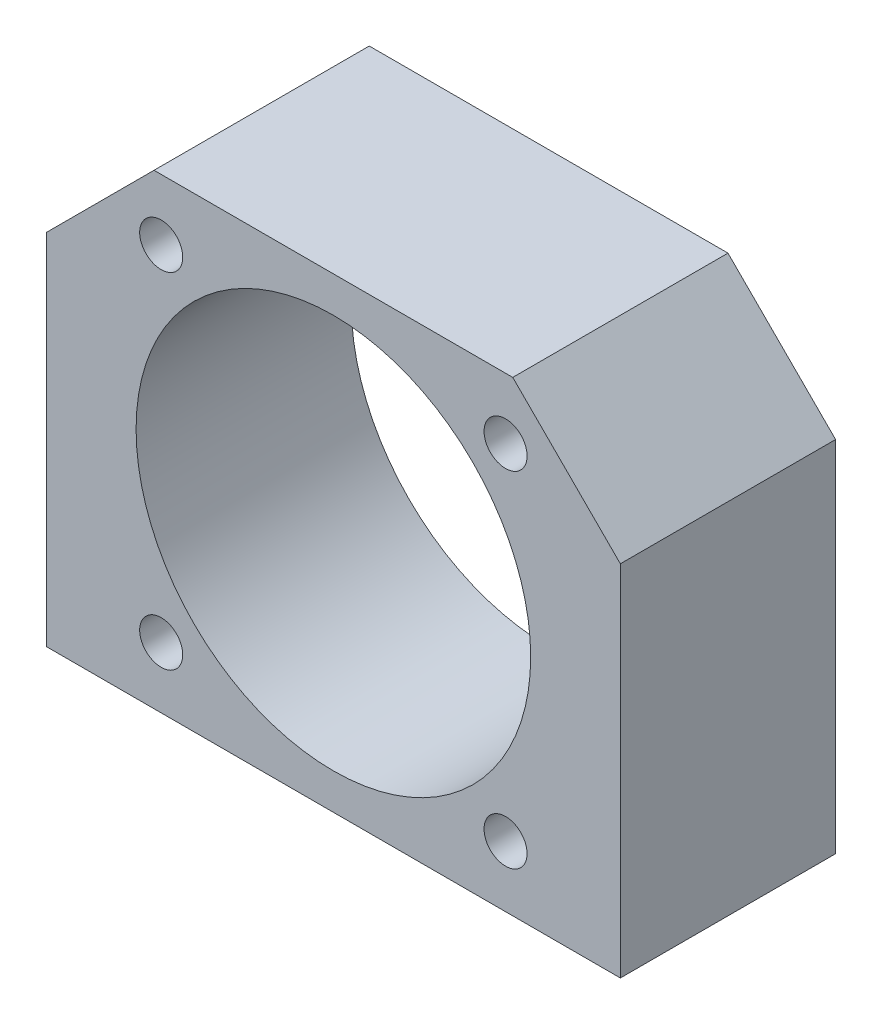
ISO-10303-21;
HEADER;
FILE_DESCRIPTION(('STEP AP214'),'2;1');
FILE_NAME('part.step','',(''),(''),'','','');
FILE_SCHEMA(('AUTOMOTIVE_DESIGN { 1 0 10303 214 1 1 1 1 }'));
ENDSEC;
DATA;
#1=APPLICATION_CONTEXT('core data for automotive mechanical design processes');
#2=APPLICATION_PROTOCOL_DEFINITION('international standard','automotive_design',2000,#1);
#3=PRODUCT_CONTEXT('',#1,'mechanical');
#4=PRODUCT('Part','Part','',(#3));
#5=PRODUCT_RELATED_PRODUCT_CATEGORY('part','',(#4));
#6=PRODUCT_DEFINITION_FORMATION('','',#4);
#7=PRODUCT_DEFINITION_CONTEXT('part definition',#1,'design');
#8=PRODUCT_DEFINITION('design','',#6,#7);
#9=PRODUCT_DEFINITION_SHAPE('','',#8);
#10=(LENGTH_UNIT() NAMED_UNIT(*) SI_UNIT(.MILLI.,.METRE.));
#11=(NAMED_UNIT(*) PLANE_ANGLE_UNIT() SI_UNIT($,.RADIAN.));
#12=(NAMED_UNIT(*) SI_UNIT($,.STERADIAN.) SOLID_ANGLE_UNIT());
#13=UNCERTAINTY_MEASURE_WITH_UNIT(LENGTH_MEASURE(1.E-05),#10,'distance_accuracy_value','');
#14=(GEOMETRIC_REPRESENTATION_CONTEXT(3) GLOBAL_UNCERTAINTY_ASSIGNED_CONTEXT((#13)) GLOBAL_UNIT_ASSIGNED_CONTEXT((#10,
#11,#12)) REPRESENTATION_CONTEXT('',''));
#15=CARTESIAN_POINT('',(0.,0.,0.));
#16=DIRECTION('',(0.,0.,1.));
#17=DIRECTION('',(1.,0.,0.));
#18=AXIS2_PLACEMENT_3D('',#15,#16,#17);
#19=CARTESIAN_POINT('',(-24.,24.,0.));
#20=DIRECTION('',(0.,0.,1.));
#21=DIRECTION('',(1.,0.,0.));
#22=AXIS2_PLACEMENT_3D('',#19,#20,#21);
#23=CYLINDRICAL_SURFACE('',#22,3.);
#24=CARTESIAN_POINT('',(-24.,24.,30.));
#25=DIRECTION('',(0.,0.,1.));
#26=DIRECTION('',(1.,0.,0.));
#27=AXIS2_PLACEMENT_3D('',#24,#25,#26);
#28=CIRCLE('',#27,3.);
#29=CARTESIAN_POINT('',(-21.,24.,30.));
#30=VERTEX_POINT('',#29);
#31=EDGE_CURVE('E168',#30,#30,#28,.T.);
#32=ORIENTED_EDGE('',*,*,#31,.T.);
#33=EDGE_LOOP('',(#32));
#34=FACE_BOUND('',#33,.T.);
#35=CARTESIAN_POINT('',(-24.,24.,6.));
#36=DIRECTION('',(0.,0.,-1.));
#37=DIRECTION('',(-1.,0.,0.));
#38=AXIS2_PLACEMENT_3D('',#35,#36,#37);
#39=CIRCLE('',#38,3.);
#40=CARTESIAN_POINT('',(-27.,24.,6.));
#41=VERTEX_POINT('',#40);
#42=EDGE_CURVE('E39',#41,#41,#39,.F.);
#43=ORIENTED_EDGE('',*,*,#42,.F.);
#44=EDGE_LOOP('',(#43));
#45=FACE_BOUND('',#44,.T.);
#46=ADVANCED_FACE('F35',(#34,#45),#23,.F.);
#47=CARTESIAN_POINT('',(24.,-24.,0.));
#48=DIRECTION('',(0.,0.,1.));
#49=DIRECTION('',(1.,0.,0.));
#50=AXIS2_PLACEMENT_3D('',#47,#48,#49);
#51=CYLINDRICAL_SURFACE('',#50,3.);
#52=CARTESIAN_POINT('',(24.,-24.,30.));
#53=DIRECTION('',(0.,0.,1.));
#54=DIRECTION('',(1.,0.,0.));
#55=AXIS2_PLACEMENT_3D('',#52,#53,#54);
#56=CIRCLE('',#55,3.);
#57=CARTESIAN_POINT('',(27.,-24.,30.));
#58=VERTEX_POINT('',#57);
#59=EDGE_CURVE('E165',#58,#58,#56,.T.);
#60=ORIENTED_EDGE('',*,*,#59,.T.);
#61=EDGE_LOOP('',(#60));
#62=FACE_BOUND('',#61,.T.);
#63=CARTESIAN_POINT('',(24.,-24.,6.));
#64=DIRECTION('',(0.,0.,-1.));
#65=DIRECTION('',(-1.,0.,0.));
#66=AXIS2_PLACEMENT_3D('',#63,#64,#65);
#67=CIRCLE('',#66,3.);
#68=CARTESIAN_POINT('',(21.,-24.,6.));
#69=VERTEX_POINT('',#68);
#70=EDGE_CURVE('E139',#69,#69,#67,.F.);
#71=ORIENTED_EDGE('',*,*,#70,.F.);
#72=EDGE_LOOP('',(#71));
#73=FACE_BOUND('',#72,.T.);
#74=ADVANCED_FACE('F210',(#62,#73),#51,.F.);
#75=CARTESIAN_POINT('',(24.,24.,0.));
#76=DIRECTION('',(0.,0.,1.));
#77=DIRECTION('',(1.,0.,0.));
#78=AXIS2_PLACEMENT_3D('',#75,#76,#77);
#79=CYLINDRICAL_SURFACE('',#78,3.);
#80=CARTESIAN_POINT('',(24.,24.,30.));
#81=DIRECTION('',(0.,0.,1.));
#82=DIRECTION('',(1.,0.,0.));
#83=AXIS2_PLACEMENT_3D('',#80,#81,#82);
#84=CIRCLE('',#83,3.);
#85=CARTESIAN_POINT('',(27.,24.,30.));
#86=VERTEX_POINT('',#85);
#87=EDGE_CURVE('E169',#86,#86,#84,.T.);
#88=ORIENTED_EDGE('',*,*,#87,.T.);
#89=EDGE_LOOP('',(#88));
#90=FACE_BOUND('',#89,.T.);
#91=CARTESIAN_POINT('',(24.,24.,6.));
#92=DIRECTION('',(0.,0.,-1.));
#93=DIRECTION('',(-1.,0.,0.));
#94=AXIS2_PLACEMENT_3D('',#91,#92,#93);
#95=CIRCLE('',#94,3.);
#96=CARTESIAN_POINT('',(21.,24.,6.));
#97=VERTEX_POINT('',#96);
#98=EDGE_CURVE('E136',#97,#97,#95,.F.);
#99=ORIENTED_EDGE('',*,*,#98,.F.);
#100=EDGE_LOOP('',(#99));
#101=FACE_BOUND('',#100,.T.);
#102=ADVANCED_FACE('F216',(#90,#101),#79,.F.);
#103=CARTESIAN_POINT('',(-24.,-24.,0.));
#104=DIRECTION('',(0.,0.,1.));
#105=DIRECTION('',(1.,0.,0.));
#106=AXIS2_PLACEMENT_3D('',#103,#104,#105);
#107=CYLINDRICAL_SURFACE('',#106,3.);
#108=CARTESIAN_POINT('',(-24.,-24.,30.));
#109=DIRECTION('',(0.,0.,1.));
#110=DIRECTION('',(1.,0.,0.));
#111=AXIS2_PLACEMENT_3D('',#108,#109,#110);
#112=CIRCLE('',#111,3.);
#113=CARTESIAN_POINT('',(-21.,-24.,30.));
#114=VERTEX_POINT('',#113);
#115=EDGE_CURVE('E160',#114,#114,#112,.T.);
#116=ORIENTED_EDGE('',*,*,#115,.T.);
#117=EDGE_LOOP('',(#116));
#118=FACE_BOUND('',#117,.T.);
#119=CARTESIAN_POINT('',(-24.,-24.,6.));
#120=DIRECTION('',(0.,0.,-1.));
#121=DIRECTION('',(-1.,0.,0.));
#122=AXIS2_PLACEMENT_3D('',#119,#120,#121);
#123=CIRCLE('',#122,3.);
#124=CARTESIAN_POINT('',(-27.,-24.,6.));
#125=VERTEX_POINT('',#124);
#126=EDGE_CURVE('E133',#125,#125,#123,.F.);
#127=ORIENTED_EDGE('',*,*,#126,.F.);
#128=EDGE_LOOP('',(#127));
#129=FACE_BOUND('',#128,.T.);
#130=ADVANCED_FACE('F222',(#118,#129),#107,.F.);
#131=CARTESIAN_POINT('',(-40.,32.5,30.));
#132=DIRECTION('',(1.,0.,0.));
#133=DIRECTION('',(0.,1.,0.));
#134=AXIS2_PLACEMENT_3D('',#131,#132,#133);
#135=PLANE('',#134);
#136=DIRECTION('',(0.,-1.,0.));
#137=VECTOR('',#136,1.);
#138=CARTESIAN_POINT('',(-40.,32.5,30.));
#139=LINE('',#138,#137);
#140=CARTESIAN_POINT('',(-40.,17.5,30.));
#141=VERTEX_POINT('',#140);
#142=CARTESIAN_POINT('',(-40.,-32.5,30.));
#143=VERTEX_POINT('',#142);
#144=EDGE_CURVE('E91',#141,#143,#139,.T.);
#145=ORIENTED_EDGE('',*,*,#144,.F.);
#146=DIRECTION('',(0.,0.,-1.));
#147=VECTOR('',#146,1.);
#148=CARTESIAN_POINT('',(-40.,17.5,30.));
#149=LINE('',#148,#147);
#150=CARTESIAN_POINT('',(-40.,17.5,0.));
#151=VERTEX_POINT('',#150);
#152=EDGE_CURVE('E115',#141,#151,#149,.T.);
#153=ORIENTED_EDGE('',*,*,#152,.T.);
#154=DIRECTION('',(0.,-1.,0.));
#155=VECTOR('',#154,1.);
#156=CARTESIAN_POINT('',(-40.,32.5,0.));
#157=LINE('',#156,#155);
#158=CARTESIAN_POINT('',(-40.,-32.5,0.));
#159=VERTEX_POINT('',#158);
#160=EDGE_CURVE('E113',#151,#159,#157,.T.);
#161=ORIENTED_EDGE('',*,*,#160,.T.);
#162=DIRECTION('',(0.,0.,-1.));
#163=VECTOR('',#162,1.);
#164=CARTESIAN_POINT('',(-40.,-32.5,30.));
#165=LINE('',#164,#163);
#166=EDGE_CURVE('E106',#143,#159,#165,.T.);
#167=ORIENTED_EDGE('',*,*,#166,.F.);
#168=EDGE_LOOP('',(#145,#153,#161,#167));
#169=FACE_BOUND('',#168,.T.);
#170=ADVANCED_FACE('F111',(#169),#135,.F.);
#171=CARTESIAN_POINT('',(-40.,-32.5,30.));
#172=DIRECTION('',(0.,1.,0.));
#173=DIRECTION('',(0.,0.,1.));
#174=AXIS2_PLACEMENT_3D('',#171,#172,#173);
#175=PLANE('',#174);
#176=CARTESIAN_POINT('',(-33.,-32.5,7.));
#177=DIRECTION('',(0.,-1.,0.));
#178=DIRECTION('',(0.,0.,-1.));
#179=AXIS2_PLACEMENT_3D('',#176,#177,#178);
#180=CIRCLE('',#179,3.);
#181=CARTESIAN_POINT('',(-33.,-32.5,4.));
#182=VERTEX_POINT('',#181);
#183=EDGE_CURVE('E144',#182,#182,#180,.T.);
#184=ORIENTED_EDGE('',*,*,#183,.F.);
#185=EDGE_LOOP('',(#184));
#186=FACE_BOUND('',#185,.T.);
#187=CARTESIAN_POINT('',(33.,-32.5,7.));
#188=DIRECTION('',(0.,-1.,0.));
#189=DIRECTION('',(0.,0.,-1.));
#190=AXIS2_PLACEMENT_3D('',#187,#188,#189);
#191=CIRCLE('',#190,3.);
#192=CARTESIAN_POINT('',(33.,-32.5,4.));
#193=VERTEX_POINT('',#192);
#194=EDGE_CURVE('E153',#193,#193,#191,.T.);
#195=ORIENTED_EDGE('',*,*,#194,.F.);
#196=EDGE_LOOP('',(#195));
#197=FACE_BOUND('',#196,.T.);
#198=CARTESIAN_POINT('',(33.,-32.5,23.));
#199=DIRECTION('',(0.,-1.,0.));
#200=DIRECTION('',(0.,0.,-1.));
#201=AXIS2_PLACEMENT_3D('',#198,#199,#200);
#202=CIRCLE('',#201,3.);
#203=CARTESIAN_POINT('',(33.,-32.5,20.));
#204=VERTEX_POINT('',#203);
#205=EDGE_CURVE('E444',#204,#204,#202,.T.);
#206=ORIENTED_EDGE('',*,*,#205,.F.);
#207=EDGE_LOOP('',(#206));
#208=FACE_BOUND('',#207,.T.);
#209=CARTESIAN_POINT('',(-33.,-32.5,23.));
#210=DIRECTION('',(0.,-1.,0.));
#211=DIRECTION('',(0.,0.,-1.));
#212=AXIS2_PLACEMENT_3D('',#209,#210,#211);
#213=CIRCLE('',#212,3.);
#214=CARTESIAN_POINT('',(-33.,-32.5,20.));
#215=VERTEX_POINT('',#214);
#216=EDGE_CURVE('E161',#215,#215,#213,.T.);
#217=ORIENTED_EDGE('',*,*,#216,.F.);
#218=EDGE_LOOP('',(#217));
#219=FACE_BOUND('',#218,.T.);
#220=DIRECTION('',(1.,0.,0.));
#221=VECTOR('',#220,1.);
#222=CARTESIAN_POINT('',(-40.,-32.5,0.));
#223=LINE('',#222,#221);
#224=CARTESIAN_POINT('',(40.,-32.5,0.));
#225=VERTEX_POINT('',#224);
#226=EDGE_CURVE('E185',#159,#225,#223,.T.);
#227=ORIENTED_EDGE('',*,*,#226,.T.);
#228=DIRECTION('',(0.,0.,-1.));
#229=VECTOR('',#228,1.);
#230=CARTESIAN_POINT('',(40.,-32.5,30.));
#231=LINE('',#230,#229);
#232=CARTESIAN_POINT('',(40.,-32.5,30.));
#233=VERTEX_POINT('',#232);
#234=EDGE_CURVE('E108',#233,#225,#231,.T.);
#235=ORIENTED_EDGE('',*,*,#234,.F.);
#236=DIRECTION('',(1.,0.,0.));
#237=VECTOR('',#236,1.);
#238=CARTESIAN_POINT('',(-40.,-32.5,30.));
#239=LINE('',#238,#237);
#240=EDGE_CURVE('E94',#143,#233,#239,.T.);
#241=ORIENTED_EDGE('',*,*,#240,.F.);
#242=ORIENTED_EDGE('',*,*,#166,.T.);
#243=EDGE_LOOP('',(#227,#235,#241,#242));
#244=FACE_BOUND('',#243,.T.);
#245=ADVANCED_FACE('F105',(#186,#197,#208,#219,#244),#175,.F.);
#246=CARTESIAN_POINT('',(40.,32.5,30.));
#247=DIRECTION('',(-1.,0.,0.));
#248=DIRECTION('',(0.,-1.,0.));
#249=AXIS2_PLACEMENT_3D('',#246,#247,#248);
#250=PLANE('',#249);
#251=DIRECTION('',(0.,1.,0.));
#252=VECTOR('',#251,1.);
#253=CARTESIAN_POINT('',(40.,32.5,0.));
#254=LINE('',#253,#252);
#255=CARTESIAN_POINT('',(40.,17.4999999999999,0.));
#256=VERTEX_POINT('',#255);
#257=EDGE_CURVE('E187',#225,#256,#254,.T.);
#258=ORIENTED_EDGE('',*,*,#257,.T.);
#259=DIRECTION('',(0.,0.,1.));
#260=VECTOR('',#259,1.);
#261=CARTESIAN_POINT('',(40.,17.4999999999999,30.));
#262=LINE('',#261,#260);
#263=CARTESIAN_POINT('',(40.,17.4999999999999,30.));
#264=VERTEX_POINT('',#263);
#265=EDGE_CURVE('E11',#256,#264,#262,.T.);
#266=ORIENTED_EDGE('',*,*,#265,.T.);
#267=DIRECTION('',(0.,1.,0.));
#268=VECTOR('',#267,1.);
#269=CARTESIAN_POINT('',(40.,32.5,30.));
#270=LINE('',#269,#268);
#271=EDGE_CURVE('E109',#233,#264,#270,.T.);
#272=ORIENTED_EDGE('',*,*,#271,.F.);
#273=ORIENTED_EDGE('',*,*,#234,.T.);
#274=EDGE_LOOP('',(#258,#266,#272,#273));
#275=FACE_BOUND('',#274,.T.);
#276=ADVANCED_FACE('F196',(#275),#250,.F.);
#277=CARTESIAN_POINT('',(-40.,32.5,30.));
#278=DIRECTION('',(0.,-1.,0.));
#279=DIRECTION('',(0.,0.,-1.));
#280=AXIS2_PLACEMENT_3D('',#277,#278,#279);
#281=PLANE('',#280);
#282=DIRECTION('',(-1.,0.,0.));
#283=VECTOR('',#282,1.);
#284=CARTESIAN_POINT('',(-40.,32.5,0.));
#285=LINE('',#284,#283);
#286=CARTESIAN_POINT('',(25.,32.5,0.));
#287=VERTEX_POINT('',#286);
#288=CARTESIAN_POINT('',(-25.,32.5,0.));
#289=VERTEX_POINT('',#288);
#290=EDGE_CURVE('E101',#287,#289,#285,.T.);
#291=ORIENTED_EDGE('',*,*,#290,.T.);
#292=DIRECTION('',(0.,0.,1.));
#293=VECTOR('',#292,1.);
#294=CARTESIAN_POINT('',(-25.,32.5,30.));
#295=LINE('',#294,#293);
#296=CARTESIAN_POINT('',(-25.,32.5,30.));
#297=VERTEX_POINT('',#296);
#298=EDGE_CURVE('E58',#289,#297,#295,.T.);
#299=ORIENTED_EDGE('',*,*,#298,.T.);
#300=DIRECTION('',(-1.,0.,0.));
#301=VECTOR('',#300,1.);
#302=CARTESIAN_POINT('',(-40.,32.5,30.));
#303=LINE('',#302,#301);
#304=CARTESIAN_POINT('',(25.,32.5,30.));
#305=VERTEX_POINT('',#304);
#306=EDGE_CURVE('E119',#305,#297,#303,.T.);
#307=ORIENTED_EDGE('',*,*,#306,.F.);
#308=DIRECTION('',(0.,0.,-1.));
#309=VECTOR('',#308,1.);
#310=CARTESIAN_POINT('',(25.,32.5,30.));
#311=LINE('',#310,#309);
#312=EDGE_CURVE('E126',#305,#287,#311,.T.);
#313=ORIENTED_EDGE('',*,*,#312,.T.);
#314=EDGE_LOOP('',(#291,#299,#307,#313));
#315=FACE_BOUND('',#314,.T.);
#316=ADVANCED_FACE('F189',(#315),#281,.F.);
#317=CARTESIAN_POINT('',(0.,0.,30.));
#318=DIRECTION('',(0.,0.,1.));
#319=DIRECTION('',(1.,0.,0.));
#320=AXIS2_PLACEMENT_3D('',#317,#318,#319);
#321=PLANE('',#320);
#322=ORIENTED_EDGE('',*,*,#115,.F.);
#323=EDGE_LOOP('',(#322));
#324=FACE_BOUND('',#323,.T.);
#325=ORIENTED_EDGE('',*,*,#87,.F.);
#326=EDGE_LOOP('',(#325));
#327=FACE_BOUND('',#326,.T.);
#328=ORIENTED_EDGE('',*,*,#59,.F.);
#329=EDGE_LOOP('',(#328));
#330=FACE_BOUND('',#329,.T.);
#331=ORIENTED_EDGE('',*,*,#31,.F.);
#332=EDGE_LOOP('',(#331));
#333=FACE_BOUND('',#332,.T.);
#334=CARTESIAN_POINT('',(0.,0.,30.));
#335=DIRECTION('',(0.,0.,1.));
#336=DIRECTION('',(1.,0.,0.));
#337=AXIS2_PLACEMENT_3D('',#334,#335,#336);
#338=CIRCLE('',#337,27.5);
#339=CARTESIAN_POINT('',(27.5,0.,30.));
#340=VERTEX_POINT('',#339);
#341=EDGE_CURVE('E176',#340,#340,#338,.T.);
#342=ORIENTED_EDGE('',*,*,#341,.F.);
#343=EDGE_LOOP('',(#342));
#344=FACE_BOUND('',#343,.T.);
#345=ORIENTED_EDGE('',*,*,#306,.T.);
#346=DIRECTION('',(0.707106781186549,0.707106781186546,0.));
#347=VECTOR('',#346,1.);
#348=CARTESIAN_POINT('',(-28.7499999999999,28.75,30.));
#349=LINE('',#348,#347);
#350=EDGE_CURVE('E44',#297,#141,#349,.F.);
#351=ORIENTED_EDGE('',*,*,#350,.T.);
#352=ORIENTED_EDGE('',*,*,#144,.T.);
#353=ORIENTED_EDGE('',*,*,#240,.T.);
#354=ORIENTED_EDGE('',*,*,#271,.T.);
#355=DIRECTION('',(0.707106781186546,-0.707106781186549,0.));
#356=VECTOR('',#355,1.);
#357=CARTESIAN_POINT('',(28.75,28.7499999999999,30.));
#358=LINE('',#357,#356);
#359=EDGE_CURVE('E130',#264,#305,#358,.F.);
#360=ORIENTED_EDGE('',*,*,#359,.T.);
#361=EDGE_LOOP('',(#345,#351,#352,#353,#354,#360));
#362=FACE_BOUND('',#361,.T.);
#363=ADVANCED_FACE('F93',(#324,#327,#330,#333,#344,#362),#321,.T.);
#364=CARTESIAN_POINT('',(0.,0.,0.));
#365=DIRECTION('',(0.,0.,1.));
#366=DIRECTION('',(1.,0.,0.));
#367=AXIS2_PLACEMENT_3D('',#364,#365,#366);
#368=PLANE('',#367);
#369=CARTESIAN_POINT('',(-24.,24.,0.));
#370=DIRECTION('',(0.,0.,-1.));
#371=DIRECTION('',(-1.,0.,0.));
#372=AXIS2_PLACEMENT_3D('',#369,#370,#371);
#373=CIRCLE('',#372,5.);
#374=CARTESIAN_POINT('',(-29.,24.,0.));
#375=VERTEX_POINT('',#374);
#376=EDGE_CURVE('E431',#375,#375,#373,.T.);
#377=ORIENTED_EDGE('',*,*,#376,.F.);
#378=EDGE_LOOP('',(#377));
#379=FACE_BOUND('',#378,.T.);
#380=CARTESIAN_POINT('',(24.,24.,0.));
#381=DIRECTION('',(0.,0.,-1.));
#382=DIRECTION('',(-1.,0.,0.));
#383=AXIS2_PLACEMENT_3D('',#380,#381,#382);
#384=CIRCLE('',#383,5.);
#385=CARTESIAN_POINT('',(19.,24.,0.));
#386=VERTEX_POINT('',#385);
#387=EDGE_CURVE('E433',#386,#386,#384,.T.);
#388=ORIENTED_EDGE('',*,*,#387,.F.);
#389=EDGE_LOOP('',(#388));
#390=FACE_BOUND('',#389,.T.);
#391=CARTESIAN_POINT('',(24.,-24.,0.));
#392=DIRECTION('',(0.,0.,-1.));
#393=DIRECTION('',(-1.,0.,0.));
#394=AXIS2_PLACEMENT_3D('',#391,#392,#393);
#395=CIRCLE('',#394,5.);
#396=CARTESIAN_POINT('',(19.,-24.,0.));
#397=VERTEX_POINT('',#396);
#398=EDGE_CURVE('E461',#397,#397,#395,.T.);
#399=ORIENTED_EDGE('',*,*,#398,.F.);
#400=EDGE_LOOP('',(#399));
#401=FACE_BOUND('',#400,.T.);
#402=CARTESIAN_POINT('',(-24.,-24.,0.));
#403=DIRECTION('',(0.,0.,-1.));
#404=DIRECTION('',(-1.,0.,0.));
#405=AXIS2_PLACEMENT_3D('',#402,#403,#404);
#406=CIRCLE('',#405,5.);
#407=CARTESIAN_POINT('',(-29.,-24.,0.));
#408=VERTEX_POINT('',#407);
#409=EDGE_CURVE('E438',#408,#408,#406,.T.);
#410=ORIENTED_EDGE('',*,*,#409,.F.);
#411=EDGE_LOOP('',(#410));
#412=FACE_BOUND('',#411,.T.);
#413=CARTESIAN_POINT('',(0.,0.,0.));
#414=DIRECTION('',(0.,0.,1.));
#415=DIRECTION('',(1.,0.,0.));
#416=AXIS2_PLACEMENT_3D('',#413,#414,#415);
#417=CIRCLE('',#416,27.5);
#418=CARTESIAN_POINT('',(27.5,0.,0.));
#419=VERTEX_POINT('',#418);
#420=EDGE_CURVE('E177',#419,#419,#417,.T.);
#421=ORIENTED_EDGE('',*,*,#420,.T.);
#422=EDGE_LOOP('',(#421));
#423=FACE_BOUND('',#422,.T.);
#424=ORIENTED_EDGE('',*,*,#160,.F.);
#425=DIRECTION('',(-0.707106781186549,-0.707106781186546,0.));
#426=VECTOR('',#425,1.);
#427=CARTESIAN_POINT('',(-40.,17.5,0.));
#428=LINE('',#427,#426);
#429=EDGE_CURVE('E124',#151,#289,#428,.F.);
#430=ORIENTED_EDGE('',*,*,#429,.T.);
#431=ORIENTED_EDGE('',*,*,#290,.F.);
#432=DIRECTION('',(-0.707106781186546,0.707106781186549,0.));
#433=VECTOR('',#432,1.);
#434=CARTESIAN_POINT('',(25.,32.5,0.));
#435=LINE('',#434,#433);
#436=EDGE_CURVE('E117',#287,#256,#435,.F.);
#437=ORIENTED_EDGE('',*,*,#436,.T.);
#438=ORIENTED_EDGE('',*,*,#257,.F.);
#439=ORIENTED_EDGE('',*,*,#226,.F.);
#440=EDGE_LOOP('',(#424,#430,#431,#437,#438,#439));
#441=FACE_BOUND('',#440,.T.);
#442=ADVANCED_FACE('F194',(#379,#390,#401,#412,#423,#441),#368,.F.);
#443=CARTESIAN_POINT('',(0.,0.,0.));
#444=DIRECTION('',(0.,0.,1.));
#445=DIRECTION('',(1.,0.,0.));
#446=AXIS2_PLACEMENT_3D('',#443,#444,#445);
#447=CYLINDRICAL_SURFACE('',#446,27.5);
#448=ORIENTED_EDGE('',*,*,#420,.F.);
#449=EDGE_LOOP('',(#448));
#450=FACE_BOUND('',#449,.T.);
#451=ORIENTED_EDGE('',*,*,#341,.T.);
#452=EDGE_LOOP('',(#451));
#453=FACE_BOUND('',#452,.T.);
#454=ADVANCED_FACE('F208',(#450,#453),#447,.F.);
#455=CARTESIAN_POINT('',(-40.,17.5,30.));
#456=DIRECTION('',(0.707106781186546,-0.707106781186549,0.));
#457=DIRECTION('',(0.,0.,-1.));
#458=AXIS2_PLACEMENT_3D('',#455,#456,#457);
#459=PLANE('',#458);
#460=ORIENTED_EDGE('',*,*,#350,.F.);
#461=ORIENTED_EDGE('',*,*,#298,.F.);
#462=ORIENTED_EDGE('',*,*,#429,.F.);
#463=ORIENTED_EDGE('',*,*,#152,.F.);
#464=EDGE_LOOP('',(#460,#461,#462,#463));
#465=FACE_BOUND('',#464,.T.);
#466=ADVANCED_FACE('F193',(#465),#459,.F.);
#467=CARTESIAN_POINT('',(25.,32.5,30.));
#468=DIRECTION('',(-0.707106781186549,-0.707106781186546,0.));
#469=DIRECTION('',(0.,0.,-1.));
#470=AXIS2_PLACEMENT_3D('',#467,#468,#469);
#471=PLANE('',#470);
#472=ORIENTED_EDGE('',*,*,#359,.F.);
#473=ORIENTED_EDGE('',*,*,#265,.F.);
#474=ORIENTED_EDGE('',*,*,#436,.F.);
#475=ORIENTED_EDGE('',*,*,#312,.F.);
#476=EDGE_LOOP('',(#472,#473,#474,#475));
#477=FACE_BOUND('',#476,.T.);
#478=ADVANCED_FACE('F37',(#477),#471,.F.);
#479=CARTESIAN_POINT('',(-33.,-7.50000000000001,23.));
#480=DIRECTION('',(0.,-1.,0.));
#481=DIRECTION('',(0.,0.,-1.));
#482=AXIS2_PLACEMENT_3D('',#479,#480,#481);
#483=CYLINDRICAL_SURFACE('',#482,3.);
#484=CARTESIAN_POINT('',(-33.,-7.50000000000001,23.));
#485=DIRECTION('',(0.,-1.,0.));
#486=DIRECTION('',(0.,0.,-1.));
#487=AXIS2_PLACEMENT_3D('',#484,#485,#486);
#488=CIRCLE('',#487,3.);
#489=CARTESIAN_POINT('',(-33.,-7.50000000000001,20.));
#490=VERTEX_POINT('',#489);
#491=EDGE_CURVE('E157',#490,#490,#488,.T.);
#492=ORIENTED_EDGE('',*,*,#491,.F.);
#493=EDGE_LOOP('',(#492));
#494=FACE_BOUND('',#493,.T.);
#495=ORIENTED_EDGE('',*,*,#216,.T.);
#496=EDGE_LOOP('',(#495));
#497=FACE_BOUND('',#496,.T.);
#498=ADVANCED_FACE('F200',(#494,#497),#483,.F.);
#499=CARTESIAN_POINT('',(-33.,-7.50000000000001,23.));
#500=DIRECTION('',(0.,-1.,0.));
#501=DIRECTION('',(0.,0.,-1.));
#502=AXIS2_PLACEMENT_3D('',#499,#500,#501);
#503=PLANE('',#502);
#504=ORIENTED_EDGE('',*,*,#491,.T.);
#505=EDGE_LOOP('',(#504));
#506=FACE_BOUND('',#505,.T.);
#507=ADVANCED_FACE('F205',(#506),#503,.T.);
#508=CARTESIAN_POINT('',(33.,-7.50000000000001,23.));
#509=DIRECTION('',(0.,-1.,0.));
#510=DIRECTION('',(0.,0.,-1.));
#511=AXIS2_PLACEMENT_3D('',#508,#509,#510);
#512=CYLINDRICAL_SURFACE('',#511,3.);
#513=CARTESIAN_POINT('',(33.,-7.50000000000001,23.));
#514=DIRECTION('',(0.,-1.,0.));
#515=DIRECTION('',(0.,0.,-1.));
#516=AXIS2_PLACEMENT_3D('',#513,#514,#515);
#517=CIRCLE('',#516,3.);
#518=CARTESIAN_POINT('',(33.,-7.50000000000001,20.));
#519=VERTEX_POINT('',#518);
#520=EDGE_CURVE('E164',#519,#519,#517,.T.);
#521=ORIENTED_EDGE('',*,*,#520,.F.);
#522=EDGE_LOOP('',(#521));
#523=FACE_BOUND('',#522,.T.);
#524=ORIENTED_EDGE('',*,*,#205,.T.);
#525=EDGE_LOOP('',(#524));
#526=FACE_BOUND('',#525,.T.);
#527=ADVANCED_FACE('F278',(#523,#526),#512,.F.);
#528=CARTESIAN_POINT('',(33.,-7.50000000000001,23.));
#529=DIRECTION('',(0.,-1.,0.));
#530=DIRECTION('',(0.,0.,-1.));
#531=AXIS2_PLACEMENT_3D('',#528,#529,#530);
#532=PLANE('',#531);
#533=ORIENTED_EDGE('',*,*,#520,.T.);
#534=EDGE_LOOP('',(#533));
#535=FACE_BOUND('',#534,.T.);
#536=ADVANCED_FACE('F274',(#535),#532,.T.);
#537=CARTESIAN_POINT('',(33.,-7.50000000000001,7.));
#538=DIRECTION('',(0.,-1.,0.));
#539=DIRECTION('',(0.,0.,-1.));
#540=AXIS2_PLACEMENT_3D('',#537,#538,#539);
#541=CYLINDRICAL_SURFACE('',#540,3.);
#542=CARTESIAN_POINT('',(33.,-7.50000000000001,7.));
#543=DIRECTION('',(0.,-1.,0.));
#544=DIRECTION('',(0.,0.,-1.));
#545=AXIS2_PLACEMENT_3D('',#542,#543,#544);
#546=CIRCLE('',#545,3.);
#547=CARTESIAN_POINT('',(33.,-7.50000000000001,4.));
#548=VERTEX_POINT('',#547);
#549=EDGE_CURVE('E447',#548,#548,#546,.T.);
#550=ORIENTED_EDGE('',*,*,#549,.F.);
#551=EDGE_LOOP('',(#550));
#552=FACE_BOUND('',#551,.T.);
#553=ORIENTED_EDGE('',*,*,#194,.T.);
#554=EDGE_LOOP('',(#553));
#555=FACE_BOUND('',#554,.T.);
#556=ADVANCED_FACE('F277',(#552,#555),#541,.F.);
#557=CARTESIAN_POINT('',(33.,-7.50000000000001,7.));
#558=DIRECTION('',(0.,-1.,0.));
#559=DIRECTION('',(0.,0.,-1.));
#560=AXIS2_PLACEMENT_3D('',#557,#558,#559);
#561=PLANE('',#560);
#562=ORIENTED_EDGE('',*,*,#549,.T.);
#563=EDGE_LOOP('',(#562));
#564=FACE_BOUND('',#563,.T.);
#565=ADVANCED_FACE('F283',(#564),#561,.T.);
#566=CARTESIAN_POINT('',(-33.,-7.50000000000001,7.));
#567=DIRECTION('',(0.,-1.,0.));
#568=DIRECTION('',(0.,0.,-1.));
#569=AXIS2_PLACEMENT_3D('',#566,#567,#568);
#570=CYLINDRICAL_SURFACE('',#569,3.);
#571=CARTESIAN_POINT('',(-33.,-7.50000000000001,7.));
#572=DIRECTION('',(0.,-1.,0.));
#573=DIRECTION('',(0.,0.,-1.));
#574=AXIS2_PLACEMENT_3D('',#571,#572,#573);
#575=CIRCLE('',#574,3.);
#576=CARTESIAN_POINT('',(-33.,-7.50000000000001,4.));
#577=VERTEX_POINT('',#576);
#578=EDGE_CURVE('E148',#577,#577,#575,.T.);
#579=ORIENTED_EDGE('',*,*,#578,.F.);
#580=EDGE_LOOP('',(#579));
#581=FACE_BOUND('',#580,.T.);
#582=ORIENTED_EDGE('',*,*,#183,.T.);
#583=EDGE_LOOP('',(#582));
#584=FACE_BOUND('',#583,.T.);
#585=ADVANCED_FACE('F266',(#581,#584),#570,.F.);
#586=CARTESIAN_POINT('',(-33.,-7.50000000000001,7.));
#587=DIRECTION('',(0.,-1.,0.));
#588=DIRECTION('',(0.,0.,-1.));
#589=AXIS2_PLACEMENT_3D('',#586,#587,#588);
#590=PLANE('',#589);
#591=ORIENTED_EDGE('',*,*,#578,.T.);
#592=EDGE_LOOP('',(#591));
#593=FACE_BOUND('',#592,.T.);
#594=ADVANCED_FACE('F256',(#593),#590,.T.);
#595=CARTESIAN_POINT('',(-24.,-24.,6.));
#596=DIRECTION('',(0.,0.,-1.));
#597=DIRECTION('',(-1.,0.,0.));
#598=AXIS2_PLACEMENT_3D('',#595,#596,#597);
#599=PLANE('',#598);
#600=CARTESIAN_POINT('',(-24.,-24.,6.));
#601=DIRECTION('',(0.,0.,-1.));
#602=DIRECTION('',(-1.,0.,0.));
#603=AXIS2_PLACEMENT_3D('',#600,#601,#602);
#604=CIRCLE('',#603,5.);
#605=CARTESIAN_POINT('',(-29.,-24.,6.));
#606=VERTEX_POINT('',#605);
#607=EDGE_CURVE('E137',#606,#606,#604,.T.);
#608=ORIENTED_EDGE('',*,*,#607,.T.);
#609=EDGE_LOOP('',(#608));
#610=FACE_BOUND('',#609,.T.);
#611=ORIENTED_EDGE('',*,*,#126,.T.);
#612=EDGE_LOOP('',(#611));
#613=FACE_BOUND('',#612,.T.);
#614=ADVANCED_FACE('F253',(#610,#613),#599,.T.);
#615=CARTESIAN_POINT('',(-24.,-24.,6.));
#616=DIRECTION('',(0.,0.,-1.));
#617=DIRECTION('',(-1.,0.,0.));
#618=AXIS2_PLACEMENT_3D('',#615,#616,#617);
#619=CYLINDRICAL_SURFACE('',#618,5.);
#620=ORIENTED_EDGE('',*,*,#607,.F.);
#621=EDGE_LOOP('',(#620));
#622=FACE_BOUND('',#621,.T.);
#623=ORIENTED_EDGE('',*,*,#409,.T.);
#624=EDGE_LOOP('',(#623));
#625=FACE_BOUND('',#624,.T.);
#626=ADVANCED_FACE('F255',(#622,#625),#619,.F.);
#627=CARTESIAN_POINT('',(24.,24.,6.));
#628=DIRECTION('',(0.,0.,-1.));
#629=DIRECTION('',(-1.,0.,0.));
#630=AXIS2_PLACEMENT_3D('',#627,#628,#629);
#631=PLANE('',#630);
#632=CARTESIAN_POINT('',(24.,24.,6.));
#633=DIRECTION('',(0.,0.,-1.));
#634=DIRECTION('',(-1.,0.,0.));
#635=AXIS2_PLACEMENT_3D('',#632,#633,#634);
#636=CIRCLE('',#635,5.);
#637=CARTESIAN_POINT('',(19.,24.,6.));
#638=VERTEX_POINT('',#637);
#639=EDGE_CURVE('E465',#638,#638,#636,.T.);
#640=ORIENTED_EDGE('',*,*,#639,.T.);
#641=EDGE_LOOP('',(#640));
#642=FACE_BOUND('',#641,.T.);
#643=ORIENTED_EDGE('',*,*,#98,.T.);
#644=EDGE_LOOP('',(#643));
#645=FACE_BOUND('',#644,.T.);
#646=ADVANCED_FACE('F263',(#642,#645),#631,.T.);
#647=CARTESIAN_POINT('',(24.,24.,6.));
#648=DIRECTION('',(0.,0.,-1.));
#649=DIRECTION('',(-1.,0.,0.));
#650=AXIS2_PLACEMENT_3D('',#647,#648,#649);
#651=CYLINDRICAL_SURFACE('',#650,5.);
#652=ORIENTED_EDGE('',*,*,#639,.F.);
#653=EDGE_LOOP('',(#652));
#654=FACE_BOUND('',#653,.T.);
#655=ORIENTED_EDGE('',*,*,#387,.T.);
#656=EDGE_LOOP('',(#655));
#657=FACE_BOUND('',#656,.T.);
#658=ADVANCED_FACE('F374',(#654,#657),#651,.F.);
#659=CARTESIAN_POINT('',(24.,-24.,6.));
#660=DIRECTION('',(0.,0.,-1.));
#661=DIRECTION('',(-1.,0.,0.));
#662=AXIS2_PLACEMENT_3D('',#659,#660,#661);
#663=PLANE('',#662);
#664=CARTESIAN_POINT('',(24.,-24.,6.));
#665=DIRECTION('',(0.,0.,-1.));
#666=DIRECTION('',(-1.,0.,0.));
#667=AXIS2_PLACEMENT_3D('',#664,#665,#666);
#668=CIRCLE('',#667,5.);
#669=CARTESIAN_POINT('',(19.,-24.,6.));
#670=VERTEX_POINT('',#669);
#671=EDGE_CURVE('E441',#670,#670,#668,.T.);
#672=ORIENTED_EDGE('',*,*,#671,.T.);
#673=EDGE_LOOP('',(#672));
#674=FACE_BOUND('',#673,.T.);
#675=ORIENTED_EDGE('',*,*,#70,.T.);
#676=EDGE_LOOP('',(#675));
#677=FACE_BOUND('',#676,.T.);
#678=ADVANCED_FACE('F384',(#674,#677),#663,.T.);
#679=CARTESIAN_POINT('',(24.,-24.,6.));
#680=DIRECTION('',(0.,0.,-1.));
#681=DIRECTION('',(-1.,0.,0.));
#682=AXIS2_PLACEMENT_3D('',#679,#680,#681);
#683=CYLINDRICAL_SURFACE('',#682,5.);
#684=ORIENTED_EDGE('',*,*,#671,.F.);
#685=EDGE_LOOP('',(#684));
#686=FACE_BOUND('',#685,.T.);
#687=ORIENTED_EDGE('',*,*,#398,.T.);
#688=EDGE_LOOP('',(#687));
#689=FACE_BOUND('',#688,.T.);
#690=ADVANCED_FACE('F394',(#686,#689),#683,.F.);
#691=CARTESIAN_POINT('',(-24.,24.,6.));
#692=DIRECTION('',(0.,0.,-1.));
#693=DIRECTION('',(-1.,0.,0.));
#694=AXIS2_PLACEMENT_3D('',#691,#692,#693);
#695=PLANE('',#694);
#696=CARTESIAN_POINT('',(-24.,24.,6.));
#697=DIRECTION('',(0.,0.,-1.));
#698=DIRECTION('',(-1.,0.,0.));
#699=AXIS2_PLACEMENT_3D('',#696,#697,#698);
#700=CIRCLE('',#699,5.);
#701=CARTESIAN_POINT('',(-29.,24.,6.));
#702=VERTEX_POINT('',#701);
#703=EDGE_CURVE('E428',#702,#702,#700,.T.);
#704=ORIENTED_EDGE('',*,*,#703,.T.);
#705=EDGE_LOOP('',(#704));
#706=FACE_BOUND('',#705,.T.);
#707=ORIENTED_EDGE('',*,*,#42,.T.);
#708=EDGE_LOOP('',(#707));
#709=FACE_BOUND('',#708,.T.);
#710=ADVANCED_FACE('F404',(#706,#709),#695,.T.);
#711=CARTESIAN_POINT('',(-24.,24.,6.));
#712=DIRECTION('',(0.,0.,-1.));
#713=DIRECTION('',(-1.,0.,0.));
#714=AXIS2_PLACEMENT_3D('',#711,#712,#713);
#715=CYLINDRICAL_SURFACE('',#714,5.);
#716=ORIENTED_EDGE('',*,*,#703,.F.);
#717=EDGE_LOOP('',(#716));
#718=FACE_BOUND('',#717,.T.);
#719=ORIENTED_EDGE('',*,*,#376,.T.);
#720=EDGE_LOOP('',(#719));
#721=FACE_BOUND('',#720,.T.);
#722=ADVANCED_FACE('F271',(#718,#721),#715,.F.);
#723=CLOSED_SHELL('',(#46,#74,#102,#130,#170,#245,#276,#316,#363,#442,#454,#466,#478,#498,#507,
#527,#536,#556,#565,#585,#594,#614,#626,#646,#658,#678,#690,#710,#722));
#724=MANIFOLD_SOLID_BREP('B2',#723);
#725=ADVANCED_BREP_SHAPE_REPRESENTATION('',(#18,#724),#14);
#726=SHAPE_DEFINITION_REPRESENTATION(#9,#725);
ENDSEC;
END-ISO-10303-21;
